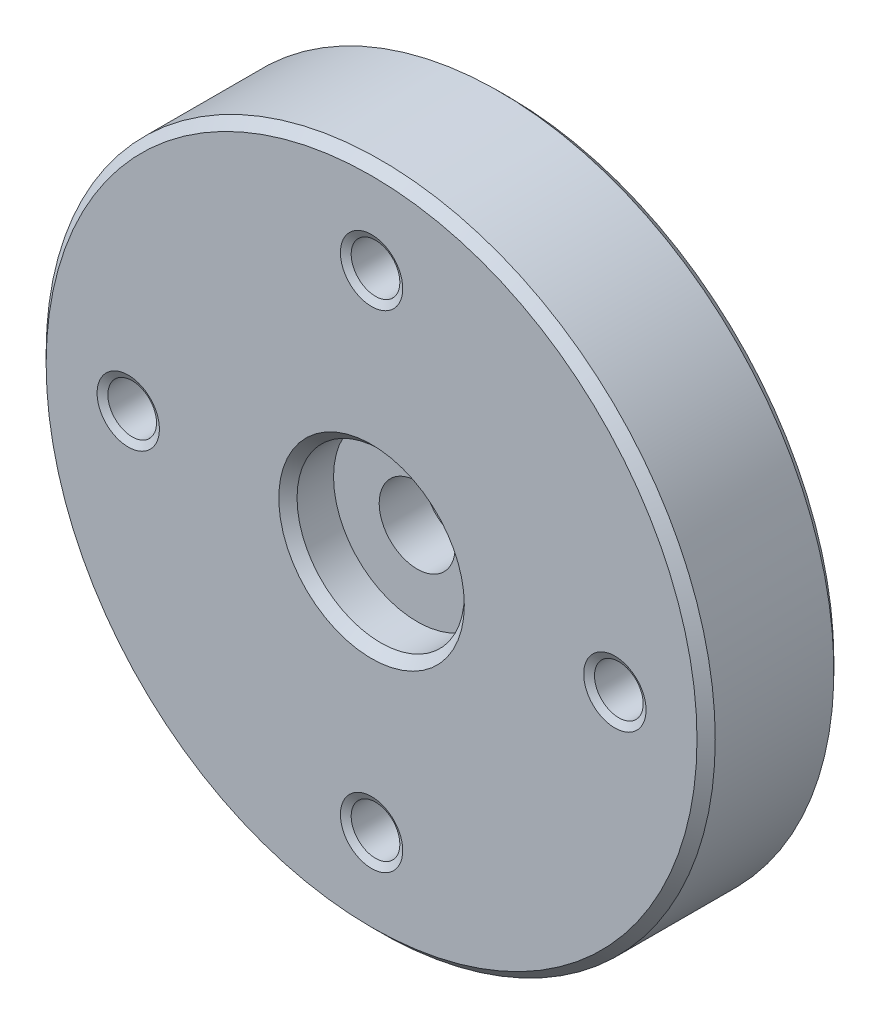
ISO-10303-21;
HEADER;
FILE_DESCRIPTION(('STEP AP214'),'2;1');
FILE_NAME('part.step','',(''),(''),'','','');
FILE_SCHEMA(('AUTOMOTIVE_DESIGN { 1 0 10303 214 1 1 1 1 }'));
ENDSEC;
DATA;
#1=APPLICATION_CONTEXT('core data for automotive mechanical design processes');
#2=APPLICATION_PROTOCOL_DEFINITION('international standard','automotive_design',2000,#1);
#3=PRODUCT_CONTEXT('',#1,'mechanical');
#4=PRODUCT('Part','Part','',(#3));
#5=PRODUCT_RELATED_PRODUCT_CATEGORY('part','',(#4));
#6=PRODUCT_DEFINITION_FORMATION('','',#4);
#7=PRODUCT_DEFINITION_CONTEXT('part definition',#1,'design');
#8=PRODUCT_DEFINITION('design','',#6,#7);
#9=PRODUCT_DEFINITION_SHAPE('','',#8);
#10=(LENGTH_UNIT() NAMED_UNIT(*) SI_UNIT(.MILLI.,.METRE.));
#11=(NAMED_UNIT(*) PLANE_ANGLE_UNIT() SI_UNIT($,.RADIAN.));
#12=(NAMED_UNIT(*) SI_UNIT($,.STERADIAN.) SOLID_ANGLE_UNIT());
#13=UNCERTAINTY_MEASURE_WITH_UNIT(LENGTH_MEASURE(1.E-05),#10,'distance_accuracy_value','');
#14=(GEOMETRIC_REPRESENTATION_CONTEXT(3) GLOBAL_UNCERTAINTY_ASSIGNED_CONTEXT((#13)) GLOBAL_UNIT_ASSIGNED_CONTEXT((#10,
#11,#12)) REPRESENTATION_CONTEXT('',''));
#15=CARTESIAN_POINT('',(0.,0.,0.));
#16=DIRECTION('',(0.,0.,1.));
#17=DIRECTION('',(1.,0.,0.));
#18=AXIS2_PLACEMENT_3D('',#15,#16,#17);
#19=CARTESIAN_POINT('',(0.,0.,0.));
#20=DIRECTION('',(0.,0.,-1.));
#21=DIRECTION('',(-1.,0.,0.));
#22=AXIS2_PLACEMENT_3D('',#19,#20,#21);
#23=CYLINDRICAL_SURFACE('',#22,2.75);
#24=CARTESIAN_POINT('',(0.,0.,-0.300000000000006));
#25=DIRECTION('',(0.,0.,1.));
#26=DIRECTION('',(1.,0.,0.));
#27=AXIS2_PLACEMENT_3D('',#24,#25,#26);
#28=CIRCLE('',#27,2.75);
#29=CARTESIAN_POINT('',(2.75,0.,-0.300000000000006));
#30=VERTEX_POINT('',#29);
#31=EDGE_CURVE('E70',#30,#30,#28,.T.);
#32=ORIENTED_EDGE('',*,*,#31,.T.);
#33=EDGE_LOOP('',(#32));
#34=FACE_BOUND('',#33,.T.);
#35=CARTESIAN_POINT('',(0.,0.,-1.5));
#36=DIRECTION('',(0.,0.,-1.));
#37=DIRECTION('',(-1.,0.,0.));
#38=AXIS2_PLACEMENT_3D('',#35,#36,#37);
#39=CIRCLE('',#38,2.75);
#40=CARTESIAN_POINT('',(-2.75,0.,-1.5));
#41=VERTEX_POINT('',#40);
#42=EDGE_CURVE('E94',#41,#41,#39,.T.);
#43=ORIENTED_EDGE('',*,*,#42,.T.);
#44=EDGE_LOOP('',(#43));
#45=FACE_BOUND('',#44,.T.);
#46=ADVANCED_FACE('F47',(#34,#45),#23,.F.);
#47=CARTESIAN_POINT('',(0.,2.75,0.));
#48=DIRECTION('',(0.,0.,1.));
#49=DIRECTION('',(1.,0.,0.));
#50=AXIS2_PLACEMENT_3D('',#47,#48,#49);
#51=PLANE('',#50);
#52=CARTESIAN_POINT('',(0.,0.,0.));
#53=DIRECTION('',(0.,0.,1.));
#54=DIRECTION('',(1.,0.,0.));
#55=AXIS2_PLACEMENT_3D('',#52,#53,#54);
#56=CIRCLE('',#55,3.05);
#57=CARTESIAN_POINT('',(3.05,0.,0.));
#58=VERTEX_POINT('',#57);
#59=EDGE_CURVE('E73',#58,#58,#56,.F.);
#60=ORIENTED_EDGE('',*,*,#59,.T.);
#61=EDGE_LOOP('',(#60));
#62=FACE_BOUND('',#61,.T.);
#63=CARTESIAN_POINT('',(0.,0.,0.));
#64=DIRECTION('',(0.,0.,1.));
#65=DIRECTION('',(1.,0.,0.));
#66=AXIS2_PLACEMENT_3D('',#63,#64,#65);
#67=CIRCLE('',#66,10.7);
#68=CARTESIAN_POINT('',(10.7,0.,0.));
#69=VERTEX_POINT('',#68);
#70=EDGE_CURVE('E76',#69,#69,#67,.T.);
#71=ORIENTED_EDGE('',*,*,#70,.T.);
#72=EDGE_LOOP('',(#71));
#73=FACE_BOUND('',#72,.T.);
#74=CARTESIAN_POINT('',(0.,8.,0.));
#75=DIRECTION('',(0.,0.,1.));
#76=DIRECTION('',(1.,0.,0.));
#77=AXIS2_PLACEMENT_3D('',#74,#75,#76);
#78=CIRCLE('',#77,1.025);
#79=CARTESIAN_POINT('',(1.025,8.,0.));
#80=VERTEX_POINT('',#79);
#81=EDGE_CURVE('E139',#80,#80,#78,.T.);
#82=ORIENTED_EDGE('',*,*,#81,.F.);
#83=EDGE_LOOP('',(#82));
#84=FACE_BOUND('',#83,.T.);
#85=CARTESIAN_POINT('',(8.,0.,0.));
#86=DIRECTION('',(0.,0.,1.));
#87=DIRECTION('',(1.,0.,0.));
#88=AXIS2_PLACEMENT_3D('',#85,#86,#87);
#89=CIRCLE('',#88,1.025);
#90=CARTESIAN_POINT('',(9.025,0.,0.));
#91=VERTEX_POINT('',#90);
#92=EDGE_CURVE('E127',#91,#91,#89,.T.);
#93=ORIENTED_EDGE('',*,*,#92,.F.);
#94=EDGE_LOOP('',(#93));
#95=FACE_BOUND('',#94,.T.);
#96=CARTESIAN_POINT('',(0.,-8.,0.));
#97=DIRECTION('',(0.,0.,1.));
#98=DIRECTION('',(1.,0.,0.));
#99=AXIS2_PLACEMENT_3D('',#96,#97,#98);
#100=CIRCLE('',#99,1.025);
#101=CARTESIAN_POINT('',(1.025,-8.,0.));
#102=VERTEX_POINT('',#101);
#103=EDGE_CURVE('E115',#102,#102,#100,.T.);
#104=ORIENTED_EDGE('',*,*,#103,.F.);
#105=EDGE_LOOP('',(#104));
#106=FACE_BOUND('',#105,.T.);
#107=CARTESIAN_POINT('',(-8.,0.,0.));
#108=DIRECTION('',(0.,0.,1.));
#109=DIRECTION('',(1.,0.,0.));
#110=AXIS2_PLACEMENT_3D('',#107,#108,#109);
#111=CIRCLE('',#110,1.025);
#112=CARTESIAN_POINT('',(-6.975,0.,0.));
#113=VERTEX_POINT('',#112);
#114=EDGE_CURVE('E103',#113,#113,#111,.T.);
#115=ORIENTED_EDGE('',*,*,#114,.F.);
#116=EDGE_LOOP('',(#115));
#117=FACE_BOUND('',#116,.T.);
#118=ADVANCED_FACE('F169',(#62,#73,#84,#95,#106,#117),#51,.T.);
#119=CARTESIAN_POINT('',(0.,0.,0.));
#120=DIRECTION('',(0.,0.,-1.));
#121=DIRECTION('',(-1.,0.,0.));
#122=AXIS2_PLACEMENT_3D('',#119,#120,#121);
#123=CYLINDRICAL_SURFACE('',#122,11.);
#124=CARTESIAN_POINT('',(0.,0.,-4.2));
#125=DIRECTION('',(0.,0.,-1.));
#126=DIRECTION('',(-1.,0.,0.));
#127=AXIS2_PLACEMENT_3D('',#124,#125,#126);
#128=CIRCLE('',#127,11.);
#129=CARTESIAN_POINT('',(-11.,0.,-4.2));
#130=VERTEX_POINT('',#129);
#131=EDGE_CURVE('E10',#130,#130,#128,.F.);
#132=ORIENTED_EDGE('',*,*,#131,.T.);
#133=EDGE_LOOP('',(#132));
#134=FACE_BOUND('',#133,.T.);
#135=CARTESIAN_POINT('',(0.,0.,-0.299999999999998));
#136=DIRECTION('',(0.,0.,1.));
#137=DIRECTION('',(1.,0.,0.));
#138=AXIS2_PLACEMENT_3D('',#135,#136,#137);
#139=CIRCLE('',#138,11.);
#140=CARTESIAN_POINT('',(11.,0.,-0.299999999999998));
#141=VERTEX_POINT('',#140);
#142=EDGE_CURVE('E54',#141,#141,#139,.F.);
#143=ORIENTED_EDGE('',*,*,#142,.T.);
#144=EDGE_LOOP('',(#143));
#145=FACE_BOUND('',#144,.T.);
#146=ADVANCED_FACE('F172',(#134,#145),#123,.T.);
#147=CARTESIAN_POINT('',(0.,11.,-4.5));
#148=DIRECTION('',(0.,0.,-1.));
#149=DIRECTION('',(-1.,0.,0.));
#150=AXIS2_PLACEMENT_3D('',#147,#148,#149);
#151=PLANE('',#150);
#152=CARTESIAN_POINT('',(0.,0.,-4.5));
#153=DIRECTION('',(0.,0.,-1.));
#154=DIRECTION('',(-1.,0.,0.));
#155=AXIS2_PLACEMENT_3D('',#152,#153,#154);
#156=CIRCLE('',#155,10.7);
#157=CARTESIAN_POINT('',(-10.7,0.,-4.5));
#158=VERTEX_POINT('',#157);
#159=EDGE_CURVE('E58',#158,#158,#156,.T.);
#160=ORIENTED_EDGE('',*,*,#159,.T.);
#161=EDGE_LOOP('',(#160));
#162=FACE_BOUND('',#161,.T.);
#163=CARTESIAN_POINT('',(0.,8.,-4.5));
#164=DIRECTION('',(0.,0.,1.));
#165=DIRECTION('',(1.,0.,0.));
#166=AXIS2_PLACEMENT_3D('',#163,#164,#165);
#167=CIRCLE('',#166,1.025);
#168=CARTESIAN_POINT('',(1.025,8.,-4.5));
#169=VERTEX_POINT('',#168);
#170=EDGE_CURVE('E142',#169,#169,#167,.T.);
#171=ORIENTED_EDGE('',*,*,#170,.T.);
#172=EDGE_LOOP('',(#171));
#173=FACE_BOUND('',#172,.T.);
#174=CARTESIAN_POINT('',(8.,0.,-4.5));
#175=DIRECTION('',(0.,0.,1.));
#176=DIRECTION('',(1.,0.,0.));
#177=AXIS2_PLACEMENT_3D('',#174,#175,#176);
#178=CIRCLE('',#177,1.025);
#179=CARTESIAN_POINT('',(9.025,0.,-4.5));
#180=VERTEX_POINT('',#179);
#181=EDGE_CURVE('E130',#180,#180,#178,.T.);
#182=ORIENTED_EDGE('',*,*,#181,.T.);
#183=EDGE_LOOP('',(#182));
#184=FACE_BOUND('',#183,.T.);
#185=CARTESIAN_POINT('',(0.,-8.,-4.5));
#186=DIRECTION('',(0.,0.,1.));
#187=DIRECTION('',(1.,0.,0.));
#188=AXIS2_PLACEMENT_3D('',#185,#186,#187);
#189=CIRCLE('',#188,1.025);
#190=CARTESIAN_POINT('',(1.025,-8.,-4.5));
#191=VERTEX_POINT('',#190);
#192=EDGE_CURVE('E118',#191,#191,#189,.T.);
#193=ORIENTED_EDGE('',*,*,#192,.T.);
#194=EDGE_LOOP('',(#193));
#195=FACE_BOUND('',#194,.T.);
#196=CARTESIAN_POINT('',(-8.,0.,-4.5));
#197=DIRECTION('',(0.,0.,1.));
#198=DIRECTION('',(1.,0.,0.));
#199=AXIS2_PLACEMENT_3D('',#196,#197,#198);
#200=CIRCLE('',#199,1.025);
#201=CARTESIAN_POINT('',(-6.975,0.,-4.5));
#202=VERTEX_POINT('',#201);
#203=EDGE_CURVE('E106',#202,#202,#200,.T.);
#204=ORIENTED_EDGE('',*,*,#203,.T.);
#205=EDGE_LOOP('',(#204));
#206=FACE_BOUND('',#205,.T.);
#207=CARTESIAN_POINT('',(0.,0.,-4.5));
#208=DIRECTION('',(0.,0.,-1.));
#209=DIRECTION('',(-1.,0.,0.));
#210=AXIS2_PLACEMENT_3D('',#207,#208,#209);
#211=CIRCLE('',#210,4.5);
#212=CARTESIAN_POINT('',(-4.5,0.,-4.5));
#213=VERTEX_POINT('',#212);
#214=EDGE_CURVE('E79',#213,#213,#211,.T.);
#215=ORIENTED_EDGE('',*,*,#214,.F.);
#216=EDGE_LOOP('',(#215));
#217=FACE_BOUND('',#216,.T.);
#218=ADVANCED_FACE('F146',(#162,#173,#184,#195,#206,#217),#151,.T.);
#219=CARTESIAN_POINT('',(0.,0.,0.));
#220=DIRECTION('',(0.,0.,-1.));
#221=DIRECTION('',(-1.,0.,0.));
#222=AXIS2_PLACEMENT_3D('',#219,#220,#221);
#223=CYLINDRICAL_SURFACE('',#222,4.5);
#224=CARTESIAN_POINT('',(0.,0.,-6.4));
#225=DIRECTION('',(0.,0.,-1.));
#226=DIRECTION('',(-1.,0.,0.));
#227=AXIS2_PLACEMENT_3D('',#224,#225,#226);
#228=CIRCLE('',#227,4.5);
#229=CARTESIAN_POINT('',(-4.5,0.,-6.4));
#230=VERTEX_POINT('',#229);
#231=EDGE_CURVE('E62',#230,#230,#228,.F.);
#232=ORIENTED_EDGE('',*,*,#231,.T.);
#233=EDGE_LOOP('',(#232));
#234=FACE_BOUND('',#233,.T.);
#235=ORIENTED_EDGE('',*,*,#214,.T.);
#236=EDGE_LOOP('',(#235));
#237=FACE_BOUND('',#236,.T.);
#238=ADVANCED_FACE('F226',(#234,#237),#223,.T.);
#239=CARTESIAN_POINT('',(0.,4.5,-6.7));
#240=DIRECTION('',(0.,0.,-1.));
#241=DIRECTION('',(-1.,0.,0.));
#242=AXIS2_PLACEMENT_3D('',#239,#240,#241);
#243=PLANE('',#242);
#244=CARTESIAN_POINT('',(0.,0.,-6.7));
#245=DIRECTION('',(0.,0.,-1.));
#246=DIRECTION('',(-1.,0.,0.));
#247=AXIS2_PLACEMENT_3D('',#244,#245,#246);
#248=CIRCLE('',#247,4.2);
#249=CARTESIAN_POINT('',(-4.2,0.,-6.7));
#250=VERTEX_POINT('',#249);
#251=EDGE_CURVE('E67',#250,#250,#248,.T.);
#252=ORIENTED_EDGE('',*,*,#251,.T.);
#253=EDGE_LOOP('',(#252));
#254=FACE_BOUND('',#253,.T.);
#255=CARTESIAN_POINT('',(0.,0.,-6.7));
#256=DIRECTION('',(0.,0.,-1.));
#257=DIRECTION('',(-1.,0.,0.));
#258=AXIS2_PLACEMENT_3D('',#255,#256,#257);
#259=CIRCLE('',#258,2.75);
#260=CARTESIAN_POINT('',(-2.75,0.,-6.7));
#261=VERTEX_POINT('',#260);
#262=EDGE_CURVE('E82',#261,#261,#259,.T.);
#263=ORIENTED_EDGE('',*,*,#262,.F.);
#264=EDGE_LOOP('',(#263));
#265=FACE_BOUND('',#264,.T.);
#266=ADVANCED_FACE('F232',(#254,#265),#243,.T.);
#267=CARTESIAN_POINT('',(0.,0.,0.));
#268=DIRECTION('',(0.,0.,-1.));
#269=DIRECTION('',(-1.,0.,0.));
#270=AXIS2_PLACEMENT_3D('',#267,#268,#269);
#271=CYLINDRICAL_SURFACE('',#270,2.75);
#272=ORIENTED_EDGE('',*,*,#262,.T.);
#273=EDGE_LOOP('',(#272));
#274=FACE_BOUND('',#273,.T.);
#275=CARTESIAN_POINT('',(0.,0.,-3.));
#276=DIRECTION('',(0.,0.,-1.));
#277=DIRECTION('',(-1.,0.,0.));
#278=AXIS2_PLACEMENT_3D('',#275,#276,#277);
#279=CIRCLE('',#278,2.75);
#280=CARTESIAN_POINT('',(-2.75,0.,-3.));
#281=VERTEX_POINT('',#280);
#282=EDGE_CURVE('E85',#281,#281,#279,.T.);
#283=ORIENTED_EDGE('',*,*,#282,.F.);
#284=EDGE_LOOP('',(#283));
#285=FACE_BOUND('',#284,.T.);
#286=ADVANCED_FACE('F238',(#274,#285),#271,.F.);
#287=CARTESIAN_POINT('',(0.,2.75,-3.));
#288=DIRECTION('',(0.,0.,-1.));
#289=DIRECTION('',(-1.,0.,0.));
#290=AXIS2_PLACEMENT_3D('',#287,#288,#289);
#291=PLANE('',#290);
#292=ORIENTED_EDGE('',*,*,#282,.T.);
#293=EDGE_LOOP('',(#292));
#294=FACE_BOUND('',#293,.T.);
#295=CARTESIAN_POINT('',(0.,0.,-3.));
#296=DIRECTION('',(0.,0.,-1.));
#297=DIRECTION('',(-1.,0.,0.));
#298=AXIS2_PLACEMENT_3D('',#295,#296,#297);
#299=CIRCLE('',#298,1.25);
#300=CARTESIAN_POINT('',(-1.25,0.,-3.));
#301=VERTEX_POINT('',#300);
#302=EDGE_CURVE('E88',#301,#301,#299,.T.);
#303=ORIENTED_EDGE('',*,*,#302,.F.);
#304=EDGE_LOOP('',(#303));
#305=FACE_BOUND('',#304,.T.);
#306=ADVANCED_FACE('F242',(#294,#305),#291,.T.);
#307=CARTESIAN_POINT('',(0.,0.,0.));
#308=DIRECTION('',(0.,0.,-1.));
#309=DIRECTION('',(-1.,0.,0.));
#310=AXIS2_PLACEMENT_3D('',#307,#308,#309);
#311=CYLINDRICAL_SURFACE('',#310,1.25);
#312=ORIENTED_EDGE('',*,*,#302,.T.);
#313=EDGE_LOOP('',(#312));
#314=FACE_BOUND('',#313,.T.);
#315=CARTESIAN_POINT('',(0.,0.,-1.5));
#316=DIRECTION('',(0.,0.,-1.));
#317=DIRECTION('',(-1.,0.,0.));
#318=AXIS2_PLACEMENT_3D('',#315,#316,#317);
#319=CIRCLE('',#318,1.25);
#320=CARTESIAN_POINT('',(-1.25,0.,-1.5));
#321=VERTEX_POINT('',#320);
#322=EDGE_CURVE('E91',#321,#321,#319,.T.);
#323=ORIENTED_EDGE('',*,*,#322,.F.);
#324=EDGE_LOOP('',(#323));
#325=FACE_BOUND('',#324,.T.);
#326=ADVANCED_FACE('F246',(#314,#325),#311,.F.);
#327=CARTESIAN_POINT('',(0.,2.75,-1.5));
#328=DIRECTION('',(0.,0.,1.));
#329=DIRECTION('',(1.,0.,0.));
#330=AXIS2_PLACEMENT_3D('',#327,#328,#329);
#331=PLANE('',#330);
#332=ORIENTED_EDGE('',*,*,#322,.T.);
#333=EDGE_LOOP('',(#332));
#334=FACE_BOUND('',#333,.T.);
#335=ORIENTED_EDGE('',*,*,#42,.F.);
#336=EDGE_LOOP('',(#335));
#337=FACE_BOUND('',#336,.T.);
#338=ADVANCED_FACE('F250',(#334,#337),#331,.T.);
#339=CARTESIAN_POINT('',(-8.,0.,-4.37009618943233));
#340=DIRECTION('',(0.,0.,-1.));
#341=DIRECTION('',(-1.,0.,0.));
#342=AXIS2_PLACEMENT_3D('',#339,#340,#341);
#343=CONICAL_SURFACE('',#342,0.799999999999999,1.0471975511966);
#344=ORIENTED_EDGE('',*,*,#203,.F.);
#345=EDGE_LOOP('',(#344));
#346=FACE_BOUND('',#345,.T.);
#347=CARTESIAN_POINT('',(-8.,0.,-4.37009618943233));
#348=DIRECTION('',(0.,0.,1.));
#349=DIRECTION('',(1.,0.,0.));
#350=AXIS2_PLACEMENT_3D('',#347,#348,#349);
#351=CIRCLE('',#350,0.799999999999999);
#352=CARTESIAN_POINT('',(-7.2,0.,-4.37009618943233));
#353=VERTEX_POINT('',#352);
#354=EDGE_CURVE('E97',#353,#353,#351,.T.);
#355=ORIENTED_EDGE('',*,*,#354,.T.);
#356=EDGE_LOOP('',(#355));
#357=FACE_BOUND('',#356,.T.);
#358=ADVANCED_FACE('F195',(#346,#357),#343,.F.);
#359=CARTESIAN_POINT('',(-8.,0.,0.));
#360=DIRECTION('',(0.,0.,1.));
#361=DIRECTION('',(1.,0.,0.));
#362=AXIS2_PLACEMENT_3D('',#359,#360,#361);
#363=CYLINDRICAL_SURFACE('',#362,0.799999999999999);
#364=ORIENTED_EDGE('',*,*,#354,.F.);
#365=EDGE_LOOP('',(#364));
#366=FACE_BOUND('',#365,.T.);
#367=CARTESIAN_POINT('',(-8.,0.,-0.129903810567662));
#368=DIRECTION('',(0.,0.,1.));
#369=DIRECTION('',(1.,0.,0.));
#370=AXIS2_PLACEMENT_3D('',#367,#368,#369);
#371=CIRCLE('',#370,0.8);
#372=CARTESIAN_POINT('',(-7.2,0.,-0.129903810567662));
#373=VERTEX_POINT('',#372);
#374=EDGE_CURVE('E100',#373,#373,#371,.T.);
#375=ORIENTED_EDGE('',*,*,#374,.T.);
#376=EDGE_LOOP('',(#375));
#377=FACE_BOUND('',#376,.T.);
#378=ADVANCED_FACE('F184',(#366,#377),#363,.F.);
#379=CARTESIAN_POINT('',(-8.,0.,0.));
#380=DIRECTION('',(0.,0.,1.));
#381=DIRECTION('',(1.,0.,0.));
#382=AXIS2_PLACEMENT_3D('',#379,#380,#381);
#383=CONICAL_SURFACE('',#382,1.025,1.0471975511966);
#384=ORIENTED_EDGE('',*,*,#374,.F.);
#385=EDGE_LOOP('',(#384));
#386=FACE_BOUND('',#385,.T.);
#387=ORIENTED_EDGE('',*,*,#114,.T.);
#388=EDGE_LOOP('',(#387));
#389=FACE_BOUND('',#388,.T.);
#390=ADVANCED_FACE('F181',(#386,#389),#383,.F.);
#391=CARTESIAN_POINT('',(0.,-8.,-4.37009618943233));
#392=DIRECTION('',(0.,0.,-1.));
#393=DIRECTION('',(-1.,0.,0.));
#394=AXIS2_PLACEMENT_3D('',#391,#392,#393);
#395=CONICAL_SURFACE('',#394,0.799999999999999,1.0471975511966);
#396=ORIENTED_EDGE('',*,*,#192,.F.);
#397=EDGE_LOOP('',(#396));
#398=FACE_BOUND('',#397,.T.);
#399=CARTESIAN_POINT('',(0.,-8.,-4.37009618943233));
#400=DIRECTION('',(0.,0.,1.));
#401=DIRECTION('',(1.,0.,0.));
#402=AXIS2_PLACEMENT_3D('',#399,#400,#401);
#403=CIRCLE('',#402,0.799999999999999);
#404=CARTESIAN_POINT('',(0.799999999999999,-8.,-4.37009618943233));
#405=VERTEX_POINT('',#404);
#406=EDGE_CURVE('E109',#405,#405,#403,.T.);
#407=ORIENTED_EDGE('',*,*,#406,.T.);
#408=EDGE_LOOP('',(#407));
#409=FACE_BOUND('',#408,.T.);
#410=ADVANCED_FACE('F183',(#398,#409),#395,.F.);
#411=CARTESIAN_POINT('',(0.,-8.,0.));
#412=DIRECTION('',(0.,0.,1.));
#413=DIRECTION('',(1.,0.,0.));
#414=AXIS2_PLACEMENT_3D('',#411,#412,#413);
#415=CYLINDRICAL_SURFACE('',#414,0.799999999999999);
#416=ORIENTED_EDGE('',*,*,#406,.F.);
#417=EDGE_LOOP('',(#416));
#418=FACE_BOUND('',#417,.T.);
#419=CARTESIAN_POINT('',(0.,-8.,-0.129903810567662));
#420=DIRECTION('',(0.,0.,1.));
#421=DIRECTION('',(1.,0.,0.));
#422=AXIS2_PLACEMENT_3D('',#419,#420,#421);
#423=CIRCLE('',#422,0.8);
#424=CARTESIAN_POINT('',(0.8,-8.,-0.129903810567662));
#425=VERTEX_POINT('',#424);
#426=EDGE_CURVE('E112',#425,#425,#423,.T.);
#427=ORIENTED_EDGE('',*,*,#426,.T.);
#428=EDGE_LOOP('',(#427));
#429=FACE_BOUND('',#428,.T.);
#430=ADVANCED_FACE('F191',(#418,#429),#415,.F.);
#431=CARTESIAN_POINT('',(0.,-8.,0.));
#432=DIRECTION('',(0.,0.,1.));
#433=DIRECTION('',(1.,0.,0.));
#434=AXIS2_PLACEMENT_3D('',#431,#432,#433);
#435=CONICAL_SURFACE('',#434,1.025,1.0471975511966);
#436=ORIENTED_EDGE('',*,*,#426,.F.);
#437=EDGE_LOOP('',(#436));
#438=FACE_BOUND('',#437,.T.);
#439=ORIENTED_EDGE('',*,*,#103,.T.);
#440=EDGE_LOOP('',(#439));
#441=FACE_BOUND('',#440,.T.);
#442=ADVANCED_FACE('F295',(#438,#441),#435,.F.);
#443=CARTESIAN_POINT('',(8.,0.,-4.37009618943233));
#444=DIRECTION('',(0.,0.,-1.));
#445=DIRECTION('',(-1.,0.,0.));
#446=AXIS2_PLACEMENT_3D('',#443,#444,#445);
#447=CONICAL_SURFACE('',#446,0.799999999999999,1.04719755119659);
#448=ORIENTED_EDGE('',*,*,#181,.F.);
#449=EDGE_LOOP('',(#448));
#450=FACE_BOUND('',#449,.T.);
#451=CARTESIAN_POINT('',(8.,0.,-4.37009618943233));
#452=DIRECTION('',(0.,0.,1.));
#453=DIRECTION('',(1.,0.,0.));
#454=AXIS2_PLACEMENT_3D('',#451,#452,#453);
#455=CIRCLE('',#454,0.799999999999999);
#456=CARTESIAN_POINT('',(8.8,0.,-4.37009618943233));
#457=VERTEX_POINT('',#456);
#458=EDGE_CURVE('E121',#457,#457,#455,.T.);
#459=ORIENTED_EDGE('',*,*,#458,.T.);
#460=EDGE_LOOP('',(#459));
#461=FACE_BOUND('',#460,.T.);
#462=ADVANCED_FACE('F306',(#450,#461),#447,.F.);
#463=CARTESIAN_POINT('',(8.,0.,0.));
#464=DIRECTION('',(0.,0.,1.));
#465=DIRECTION('',(1.,0.,0.));
#466=AXIS2_PLACEMENT_3D('',#463,#464,#465);
#467=CYLINDRICAL_SURFACE('',#466,0.799999999999999);
#468=ORIENTED_EDGE('',*,*,#458,.F.);
#469=EDGE_LOOP('',(#468));
#470=FACE_BOUND('',#469,.T.);
#471=CARTESIAN_POINT('',(8.,0.,-0.129903810567662));
#472=DIRECTION('',(0.,0.,1.));
#473=DIRECTION('',(1.,0.,0.));
#474=AXIS2_PLACEMENT_3D('',#471,#472,#473);
#475=CIRCLE('',#474,0.8);
#476=CARTESIAN_POINT('',(8.8,0.,-0.129903810567662));
#477=VERTEX_POINT('',#476);
#478=EDGE_CURVE('E124',#477,#477,#475,.T.);
#479=ORIENTED_EDGE('',*,*,#478,.T.);
#480=EDGE_LOOP('',(#479));
#481=FACE_BOUND('',#480,.T.);
#482=ADVANCED_FACE('F315',(#470,#481),#467,.F.);
#483=CARTESIAN_POINT('',(8.,0.,0.));
#484=DIRECTION('',(0.,0.,1.));
#485=DIRECTION('',(1.,0.,0.));
#486=AXIS2_PLACEMENT_3D('',#483,#484,#485);
#487=CONICAL_SURFACE('',#486,1.025,1.0471975511966);
#488=ORIENTED_EDGE('',*,*,#478,.F.);
#489=EDGE_LOOP('',(#488));
#490=FACE_BOUND('',#489,.T.);
#491=ORIENTED_EDGE('',*,*,#92,.T.);
#492=EDGE_LOOP('',(#491));
#493=FACE_BOUND('',#492,.T.);
#494=ADVANCED_FACE('F153',(#490,#493),#487,.F.);
#495=CARTESIAN_POINT('',(0.,8.,-4.37009618943233));
#496=DIRECTION('',(0.,0.,-1.));
#497=DIRECTION('',(-1.,0.,0.));
#498=AXIS2_PLACEMENT_3D('',#495,#496,#497);
#499=CONICAL_SURFACE('',#498,0.799999999999999,1.0471975511966);
#500=ORIENTED_EDGE('',*,*,#170,.F.);
#501=EDGE_LOOP('',(#500));
#502=FACE_BOUND('',#501,.T.);
#503=CARTESIAN_POINT('',(0.,8.,-4.37009618943233));
#504=DIRECTION('',(0.,0.,1.));
#505=DIRECTION('',(1.,0.,0.));
#506=AXIS2_PLACEMENT_3D('',#503,#504,#505);
#507=CIRCLE('',#506,0.799999999999999);
#508=CARTESIAN_POINT('',(0.799999999999999,8.,-4.37009618943233));
#509=VERTEX_POINT('',#508);
#510=EDGE_CURVE('E133',#509,#509,#507,.T.);
#511=ORIENTED_EDGE('',*,*,#510,.T.);
#512=EDGE_LOOP('',(#511));
#513=FACE_BOUND('',#512,.T.);
#514=ADVANCED_FACE('F149',(#502,#513),#499,.F.);
#515=CARTESIAN_POINT('',(0.,8.,0.));
#516=DIRECTION('',(0.,0.,1.));
#517=DIRECTION('',(1.,0.,0.));
#518=AXIS2_PLACEMENT_3D('',#515,#516,#517);
#519=CYLINDRICAL_SURFACE('',#518,0.799999999999999);
#520=ORIENTED_EDGE('',*,*,#510,.F.);
#521=EDGE_LOOP('',(#520));
#522=FACE_BOUND('',#521,.T.);
#523=CARTESIAN_POINT('',(0.,8.,-0.129903810567662));
#524=DIRECTION('',(0.,0.,1.));
#525=DIRECTION('',(1.,0.,0.));
#526=AXIS2_PLACEMENT_3D('',#523,#524,#525);
#527=CIRCLE('',#526,0.8);
#528=CARTESIAN_POINT('',(0.8,8.,-0.129903810567662));
#529=VERTEX_POINT('',#528);
#530=EDGE_CURVE('E136',#529,#529,#527,.T.);
#531=ORIENTED_EDGE('',*,*,#530,.T.);
#532=EDGE_LOOP('',(#531));
#533=FACE_BOUND('',#532,.T.);
#534=ADVANCED_FACE('F152',(#522,#533),#519,.F.);
#535=CARTESIAN_POINT('',(0.,8.,0.));
#536=DIRECTION('',(0.,0.,1.));
#537=DIRECTION('',(1.,0.,0.));
#538=AXIS2_PLACEMENT_3D('',#535,#536,#537);
#539=CONICAL_SURFACE('',#538,1.025,1.0471975511966);
#540=ORIENTED_EDGE('',*,*,#530,.F.);
#541=EDGE_LOOP('',(#540));
#542=FACE_BOUND('',#541,.T.);
#543=ORIENTED_EDGE('',*,*,#81,.T.);
#544=EDGE_LOOP('',(#543));
#545=FACE_BOUND('',#544,.T.);
#546=ADVANCED_FACE('F159',(#542,#545),#539,.F.);
#547=CARTESIAN_POINT('',(0.,0.,0.));
#548=DIRECTION('',(0.,0.,1.));
#549=DIRECTION('',(1.,0.,0.));
#550=AXIS2_PLACEMENT_3D('',#547,#548,#549);
#551=CONICAL_SURFACE('',#550,3.05,0.78539816339744);
#552=ORIENTED_EDGE('',*,*,#31,.F.);
#553=EDGE_LOOP('',(#552));
#554=FACE_BOUND('',#553,.T.);
#555=ORIENTED_EDGE('',*,*,#59,.F.);
#556=EDGE_LOOP('',(#555));
#557=FACE_BOUND('',#556,.T.);
#558=ADVANCED_FACE('F165',(#554,#557),#551,.F.);
#559=CARTESIAN_POINT('',(0.,0.,-6.7));
#560=DIRECTION('',(0.,0.,1.));
#561=DIRECTION('',(1.,0.,0.));
#562=AXIS2_PLACEMENT_3D('',#559,#560,#561);
#563=CONICAL_SURFACE('',#562,4.2,0.785398163397445);
#564=ORIENTED_EDGE('',*,*,#231,.F.);
#565=EDGE_LOOP('',(#564));
#566=FACE_BOUND('',#565,.T.);
#567=ORIENTED_EDGE('',*,*,#251,.F.);
#568=EDGE_LOOP('',(#567));
#569=FACE_BOUND('',#568,.T.);
#570=ADVANCED_FACE('F211',(#566,#569),#563,.T.);
#571=CARTESIAN_POINT('',(0.,0.,-4.5));
#572=DIRECTION('',(0.,0.,1.));
#573=DIRECTION('',(1.,0.,0.));
#574=AXIS2_PLACEMENT_3D('',#571,#572,#573);
#575=CONICAL_SURFACE('',#574,10.7,0.785398163397451);
#576=ORIENTED_EDGE('',*,*,#131,.F.);
#577=EDGE_LOOP('',(#576));
#578=FACE_BOUND('',#577,.T.);
#579=ORIENTED_EDGE('',*,*,#159,.F.);
#580=EDGE_LOOP('',(#579));
#581=FACE_BOUND('',#580,.T.);
#582=ADVANCED_FACE('F214',(#578,#581),#575,.T.);
#583=CARTESIAN_POINT('',(0.,0.,-0.299999999999998));
#584=DIRECTION('',(0.,0.,-1.));
#585=DIRECTION('',(-1.,0.,0.));
#586=AXIS2_PLACEMENT_3D('',#583,#584,#585);
#587=CONICAL_SURFACE('',#586,11.,0.785398163397451);
#588=ORIENTED_EDGE('',*,*,#70,.F.);
#589=EDGE_LOOP('',(#588));
#590=FACE_BOUND('',#589,.T.);
#591=ORIENTED_EDGE('',*,*,#142,.F.);
#592=EDGE_LOOP('',(#591));
#593=FACE_BOUND('',#592,.T.);
#594=ADVANCED_FACE('F49',(#590,#593),#587,.T.);
#595=CLOSED_SHELL('',(#46,#118,#146,#218,#238,#266,#286,#306,#326,#338,#358,#378,#390,#410,#430,
#442,#462,#482,#494,#514,#534,#546,#558,#570,#582,#594));
#596=MANIFOLD_SOLID_BREP('B2',#595);
#597=ADVANCED_BREP_SHAPE_REPRESENTATION('',(#18,#596),#14);
#598=SHAPE_DEFINITION_REPRESENTATION(#9,#597);
ENDSEC;
END-ISO-10303-21;
